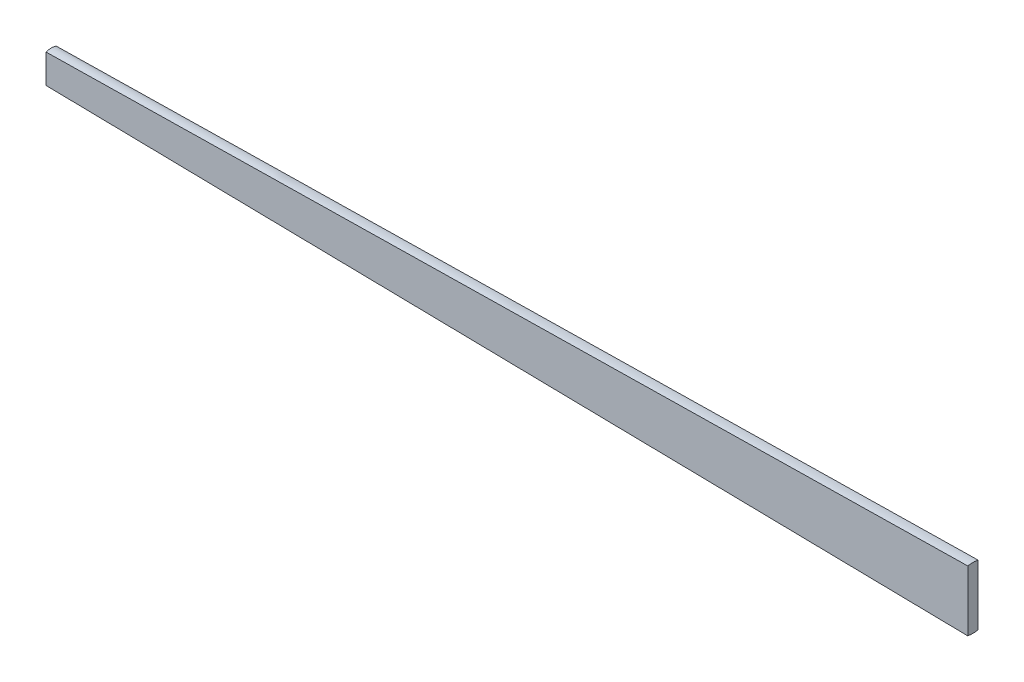
ISO-10303-21;
HEADER;
FILE_DESCRIPTION(('STEP AP214'),'2;1');
FILE_NAME('part.step','',(''),(''),'','','');
FILE_SCHEMA(('AUTOMOTIVE_DESIGN { 1 0 10303 214 1 1 1 1 }'));
ENDSEC;
DATA;
#1=APPLICATION_CONTEXT('core data for automotive mechanical design processes');
#2=APPLICATION_PROTOCOL_DEFINITION('international standard','automotive_design',2000,#1);
#3=PRODUCT_CONTEXT('',#1,'mechanical');
#4=PRODUCT('Part','Part','',(#3));
#5=PRODUCT_RELATED_PRODUCT_CATEGORY('part','',(#4));
#6=PRODUCT_DEFINITION_FORMATION('','',#4);
#7=PRODUCT_DEFINITION_CONTEXT('part definition',#1,'design');
#8=PRODUCT_DEFINITION('design','',#6,#7);
#9=PRODUCT_DEFINITION_SHAPE('','',#8);
#10=(LENGTH_UNIT() NAMED_UNIT(*) SI_UNIT(.MILLI.,.METRE.));
#11=(NAMED_UNIT(*) PLANE_ANGLE_UNIT() SI_UNIT($,.RADIAN.));
#12=(NAMED_UNIT(*) SI_UNIT($,.STERADIAN.) SOLID_ANGLE_UNIT());
#13=UNCERTAINTY_MEASURE_WITH_UNIT(LENGTH_MEASURE(1.E-05),#10,'distance_accuracy_value','');
#14=(GEOMETRIC_REPRESENTATION_CONTEXT(3) GLOBAL_UNCERTAINTY_ASSIGNED_CONTEXT((#13)) GLOBAL_UNIT_ASSIGNED_CONTEXT((#10,
#11,#12)) REPRESENTATION_CONTEXT('',''));
#15=CARTESIAN_POINT('',(0.,0.,0.));
#16=DIRECTION('',(0.,0.,1.));
#17=DIRECTION('',(1.,0.,0.));
#18=AXIS2_PLACEMENT_3D('',#15,#16,#17);
#19=CARTESIAN_POINT('',(-10.5482343550447,2.95803989154981,-0.500000000000001));
#20=DIRECTION('',(0.,0.,1.));
#21=DIRECTION('',(1.,0.,0.));
#22=AXIS2_PLACEMENT_3D('',#19,#20,#21);
#23=PLANE('',#22);
#24=CARTESIAN_POINT('',(169.656200493974,-4.47539671188116,-0.500000000000001));
#25=CARTESIAN_POINT('',(166.703664294802,-4.42588148318487,-0.500000000000001));
#26=CARTESIAN_POINT('',(163.7511282617,-4.37635634763244,-0.500000000000001));
#27=CARTESIAN_POINT('',(154.893500783821,-4.22774699927117,-0.500000000000001));
#28=CARTESIAN_POINT('',(148.988409902847,-4.12862917903997,-0.500000000000001));
#29=CARTESIAN_POINT('',(140.130794713221,-3.97987001919217,-0.500000000000001));
#30=CARTESIAN_POINT('',(137.178269709589,-3.93027006028798,-0.500000000000001));
#31=CARTESIAN_POINT('',(131.273220624869,-3.83103897027866,-0.500000000000001));
#32=CARTESIAN_POINT('',(128.320696543779,-3.78140783917772,-0.500000000000001));
#33=CARTESIAN_POINT('',(113.558381591971,-3.53317134744906,-0.500000000000001));
#34=CARTESIAN_POINT('',(101.748595056309,-3.33430815609334,-0.500000000000001));
#35=CARTESIAN_POINT('',(78.1290247302832,-2.93568248590202,-0.500000000000001));
#36=CARTESIAN_POINT('',(66.3192409399358,-2.73592000612206,-0.500000000000001));
#37=CARTESIAN_POINT('',(48.6042378005402,-2.4349762757184,-0.500000000000001));
#38=CARTESIAN_POINT('',(42.6990074646239,-2.33444203687679,-0.500000000000001));
#39=CARTESIAN_POINT('',(30.8885576156638,-2.13273241991245,-0.500000000000001));
#40=CARTESIAN_POINT('',(24.9833381026202,-2.0315570417773,-0.500000000000001));
#41=CARTESIAN_POINT('',(13.1729426179408,-1.82821800924407,-0.500000000000001));
#42=CARTESIAN_POINT('',(7.26776664622875,-1.72605435928811,-0.500000000000001));
#43=CARTESIAN_POINT('',(-4.54255679545612,-1.52010252339596,-0.500000000000001));
#44=CARTESIAN_POINT('',(-10.4477042654303,-1.41631433754119,-0.500000000000001));
#45=CARTESIAN_POINT('',(-19.8607121926004,-1.24840302755795,-0.500000000000001));
#46=CARTESIAN_POINT('',(-23.3685904619583,-1.18528205395844,-0.500000000000001));
#47=CARTESIAN_POINT('',(-28.6304048779247,-1.08925819863948,-0.500000000000001));
#48=CARTESIAN_POINT('',(-30.3843532560918,-1.05702631294972,-0.500000000000001));
#49=CARTESIAN_POINT('',(-33.8922387762595,-0.991971156105052,-0.500000000000001));
#50=CARTESIAN_POINT('',(-35.6461759182617,-0.95914788504594,-0.500000000000001));
#51=CARTESIAN_POINT('',(-39.1537391622848,-0.892710640547073,-0.500000000000001));
#52=CARTESIAN_POINT('',(-40.9073652668422,-0.85909680148814,-0.500000000000001));
#53=CARTESIAN_POINT('',(-44.4145966644938,-0.790743750861814,-0.500000000000001));
#54=CARTESIAN_POINT('',(-46.1682019575744,-0.756004538598459,-0.500000000000001));
#55=CARTESIAN_POINT('',(-49.6753155931781,-0.684864605735015,-0.500000000000001));
#56=CARTESIAN_POINT('',(-51.4288239369102,-0.648463945464205,-0.500000000000001));
#57=CARTESIAN_POINT('',(-54.0590409304299,-0.591800346433795,-0.500000000000001));
#58=CARTESIAN_POINT('',(-54.9357717583456,-0.57256872545883,-0.500000000000001));
#59=CARTESIAN_POINT('',(-56.6892123367694,-0.533169854457441,-0.500000000000001));
#60=CARTESIAN_POINT('',(-57.5659220872829,-0.513002604671453,-0.500000000000001));
#61=CARTESIAN_POINT('',(-58.8808841717626,-0.481759113686868,-0.500000000000001));
#62=CARTESIAN_POINT('',(-59.3191483164453,-0.47118017792183,-0.500000000000001));
#63=CARTESIAN_POINT('',(-60.1956673174125,-0.44961405346666,-0.500000000000001));
#64=CARTESIAN_POINT('',(-60.6339221736804,-0.438626864098665,-0.500000000000001));
#65=CARTESIAN_POINT('',(-61.510457145471,-0.416143205002311,-0.500000000000001));
#66=CARTESIAN_POINT('',(-61.9487372598603,-0.404646690913835,-0.500000000000001));
#67=CARTESIAN_POINT('',(-62.8252777193756,-0.38099961863476,-0.500000000000001));
#68=CARTESIAN_POINT('',(-63.263538064589,-0.368849063699181,-0.500000000000001));
#69=CARTESIAN_POINT('',(-64.1402692280099,-0.343670145233357,-0.500000000000001));
#70=CARTESIAN_POINT('',(-64.5787400329393,-0.330641314085127,-0.500000000000001));
#71=CARTESIAN_POINT('',(-65.4556510709307,-0.303344488101742,-0.500000000000001));
#72=CARTESIAN_POINT('',(-65.8940913032958,-0.289076470844608,-0.500000000000001));
#73=CARTESIAN_POINT('',(-66.7708240751146,-0.258681747216344,-0.500000000000001));
#74=CARTESIAN_POINT('',(-67.2091166266868,-0.24255540462692,-0.500000000000001));
#75=CARTESIAN_POINT('',(-67.8664455638075,-0.215815756695963,-0.500000000000001));
#76=CARTESIAN_POINT('',(-68.08553347561,-0.206477684036087,-0.500000000000001));
#77=CARTESIAN_POINT('',(-68.5236507261605,-0.186527394984247,-0.500000000000001));
#78=CARTESIAN_POINT('',(-68.7426800654896,-0.175915191738358,-0.500000000000001));
#79=CARTESIAN_POINT('',(-69.0711791295375,-0.158363865471682,-0.500000000000001));
#80=CARTESIAN_POINT('',(-69.180691716543,-0.152239960556255,-0.500000000000001));
#81=CARTESIAN_POINT('',(-69.3996971098207,-0.139193279631371,-0.500000000000001));
#82=CARTESIAN_POINT('',(-69.5091899037649,-0.132270298601008,-0.500000000000001));
#83=CARTESIAN_POINT('',(-69.7280470867871,-0.117223951085627,-0.500000000000001));
#84=CARTESIAN_POINT('',(-69.8374115121909,-0.109101158231657,-0.500000000000001));
#85=CARTESIAN_POINT('',(-70.0012830618837,-0.0951250513520667,-0.500000000000001));
#86=CARTESIAN_POINT('',(-70.0558678904127,-0.0901687526846374,-0.500000000000001));
#87=CARTESIAN_POINT('',(-70.1649434207622,-0.0793166070241496,-0.500000000000001));
#88=CARTESIAN_POINT('',(-70.2194341409384,-0.0734209708744558,-0.500000000000001));
#89=CARTESIAN_POINT('',(-70.3010086009303,-0.0630860165540142,-0.500000000000001));
#90=CARTESIAN_POINT('',(-70.3281917433004,-0.0593893994979068,-0.500000000000001));
#91=CARTESIAN_POINT('',(-70.3824393092316,-0.0512078894224137,-0.500000000000001));
#92=CARTESIAN_POINT('',(-70.4095038302419,-0.0467238646062233,-0.500000000000001));
#93=CARTESIAN_POINT('',(-70.449767033295,-0.038503253067891,-0.500000000000001));
#94=CARTESIAN_POINT('',(-70.4631372633285,-0.0355126058698513,-0.500000000000001));
#95=CARTESIAN_POINT('',(-70.4898346304535,-0.0286811286145645,-0.500000000000001));
#96=CARTESIAN_POINT('',(-70.5031611626841,-0.0248358726180172,-0.500000000000001));
#97=CARTESIAN_POINT('',(-70.5189920479394,-0.0179522509488759,-0.500000000000001));
#98=CARTESIAN_POINT('',(-70.5221493660641,-0.016454041373148,-0.500000000000001));
#99=CARTESIAN_POINT('',(-70.5282164673285,-0.0130463525437288,-0.500000000000001));
#100=CARTESIAN_POINT('',(-70.5311295814214,-0.0111444150867734,-0.500000000000001));
#101=CARTESIAN_POINT('',(-70.5341128071544,-0.00830005859882704,-0.500000000000001));
#102=CARTESIAN_POINT('',(-70.5345927065407,-0.00780751829092787,-0.500000000000001));
#103=CARTESIAN_POINT('',(-70.5354988825439,-0.00677267531348738,-0.500000000000001));
#104=CARTESIAN_POINT('',(-70.53592503823,-0.00623026500595271,-0.500000000000001));
#105=CARTESIAN_POINT('',(-70.5367044150295,-0.00508253231309133,-0.500000000000001));
#106=CARTESIAN_POINT('',(-70.5370565068781,-0.00447642167258438,-0.500000000000001));
#107=CARTESIAN_POINT('',(-70.5376402847741,-0.0032089449250485,-0.500000000000001));
#108=CARTESIAN_POINT('',(-70.537872470829,-0.00254782184694039,-0.500000000000001));
#109=CARTESIAN_POINT('',(-70.5381300509284,-0.00139971656199998,-0.500000000000001));
#110=CARTESIAN_POINT('',(-70.5381971940578,-0.000922122662812118,-0.500000000000001));
#111=CARTESIAN_POINT('',(-70.5382480406264,3.75242880553563E-05,-0.500000000000001));
#112=CARTESIAN_POINT('',(-70.5382317784681,0.000519575419359218,-0.500000000000001));
#113=CARTESIAN_POINT('',(-70.5381178965543,0.00147236793566272,-0.500000000000001));
#114=CARTESIAN_POINT('',(-70.5380204925058,0.00194313590577232,-0.500000000000001));
#115=CARTESIAN_POINT('',(-70.5377549229276,0.00286414571440422,-0.500000000000001));
#116=CARTESIAN_POINT('',(-70.5375866878066,0.00331436688228998,-0.500000000000001));
#117=CARTESIAN_POINT('',(-70.5370805250553,0.00443896649208909,-0.500000000000001));
#118=CARTESIAN_POINT('',(-70.5367005766963,0.00509426352120476,-0.500000000000001));
#119=CARTESIAN_POINT('',(-70.5358461312165,0.00633979415108712,-0.500000000000001));
#120=CARTESIAN_POINT('',(-70.5353713431505,0.00692981863622136,-0.500000000000001));
#121=CARTESIAN_POINT('',(-70.5336297211295,0.00887017026401274,-0.500000000000001));
#122=CARTESIAN_POINT('',(-70.5322125376018,0.0100826129074068,-0.500000000000001));
#123=CARTESIAN_POINT('',(-70.5292255565044,0.0123022808543086,-0.500000000000001));
#124=CARTESIAN_POINT('',(-70.5276547999338,0.0133080766023809,-0.500000000000001));
#125=CARTESIAN_POINT('',(-70.5200747480668,0.0177656168716723,-0.500000000000001));
#126=CARTESIAN_POINT('',(-70.5136187603176,0.0204253440446399,-0.500000000000001));
#127=CARTESIAN_POINT('',(-70.5005269121437,0.0251652815265326,-0.500000000000001));
#128=CARTESIAN_POINT('',(-70.4938904908599,0.0272433846113111,-0.500000000000001));
#129=CARTESIAN_POINT('',(-70.4607948974316,0.0368083830401033,-0.500000000000001));
#130=CARTESIAN_POINT('',(-70.4337124878969,0.0421309377949997,-0.500000000000001));
#131=CARTESIAN_POINT('',(-70.3794803350955,0.0516514435500193,-0.500000000000001));
#132=CARTESIAN_POINT('',(-70.3523307138395,0.0558507549265817,-0.500000000000001));
#133=CARTESIAN_POINT('',(-70.2709016464803,0.0673806055735255,-0.500000000000001));
#134=CARTESIAN_POINT('',(-70.2164567768172,0.0736790205104799,-0.500000000000001));
#135=CARTESIAN_POINT('',(-70.1074539347499,0.085200114193457,-0.500000000000001));
#136=CARTESIAN_POINT('',(-70.0528959175376,0.0904222179465714,-0.500000000000001));
#137=CARTESIAN_POINT('',(-69.9436910883569,0.100155814943255,-0.500000000000001));
#138=CARTESIAN_POINT('',(-69.8890442517458,0.104667055314825,-0.500000000000001));
#139=CARTESIAN_POINT('',(-69.7797284139586,0.113217429142979,-0.500000000000001));
#140=CARTESIAN_POINT('',(-69.7250594205641,0.117256668877464,-0.500000000000001));
#141=CARTESIAN_POINT('',(-69.4518803254721,0.13662801981204,-0.500000000000001));
#142=CARTESIAN_POINT('',(-69.2331998226155,0.149538255395906,-0.500000000000001));
#143=CARTESIAN_POINT('',(-68.7957026977916,0.173208459147517,-0.500000000000001));
#144=CARTESIAN_POINT('',(-68.576886060327,0.183968104492899,-0.500000000000001));
#145=CARTESIAN_POINT('',(-68.1392551796517,0.20413688850278,-0.500000000000001));
#146=CARTESIAN_POINT('',(-67.9204409555597,0.213546432845153,-0.500000000000001));
#147=CARTESIAN_POINT('',(-67.4827907431373,0.231479802406062,-0.500000000000001));
#148=CARTESIAN_POINT('',(-67.2639547569524,0.240003681685902,-0.500000000000001));
#149=CARTESIAN_POINT('',(-66.6074698905888,0.264620522552514,-0.500000000000001));
#150=CARTESIAN_POINT('',(-66.1697853159204,0.27976123325672,-0.500000000000001));
#151=CARTESIAN_POINT('',(-65.294365852186,0.30852128424575,-0.500000000000001));
#152=CARTESIAN_POINT('',(-64.8566309629206,0.322140618277633,-0.500000000000001));
#153=CARTESIAN_POINT('',(-63.5433512476529,0.361462773293233,-0.500000000000001));
#154=CARTESIAN_POINT('',(-62.6677605862346,0.385628735655631,-0.500000000000001));
#155=CARTESIAN_POINT('',(-60.9164483205709,0.431726471287231,-0.500000000000001));
#156=CARTESIAN_POINT('',(-60.0407267115126,0.453658055642433,-0.500000000000001));
#157=CARTESIAN_POINT('',(-58.2892606507878,0.496046602468688,-0.500000000000001));
#158=CARTESIAN_POINT('',(-57.4135161996418,0.516503586470648,-0.500000000000001));
#159=CARTESIAN_POINT('',(-54.7863755504253,0.576370027665599,-0.500000000000001));
#160=CARTESIAN_POINT('',(-53.0349453920002,0.614278150175707,-0.500000000000001));
#161=CARTESIAN_POINT('',(-49.5320379649825,0.687869510045739,-0.500000000000001));
#162=CARTESIAN_POINT('',(-47.7805606963598,0.723552745943004,-0.500000000000001));
#163=CARTESIAN_POINT('',(-44.2775647886321,0.793480099924085,-0.500000000000001));
#164=CARTESIAN_POINT('',(-42.5260461493194,0.827724207572767,-0.500000000000001));
#165=CARTESIAN_POINT('',(-39.0229904516562,0.895226026301716,-0.500000000000001));
#166=CARTESIAN_POINT('',(-37.2714533933112,0.928483737661758,-0.500000000000001));
#167=CARTESIAN_POINT('',(-32.0169856751853,1.02720288168705,-0.500000000000001));
#168=CARTESIAN_POINT('',(-28.514035303753,1.09161352043219,-0.500000000000001));
#169=CARTESIAN_POINT('',(-21.5081155805338,1.2188341835437,-0.500000000000001));
#170=CARTESIAN_POINT('',(-18.0051462288282,1.28164421241948,-0.500000000000001));
#171=CARTESIAN_POINT('',(-10.6689277173787,1.41210379956409,-0.500000000000001));
#172=CARTESIAN_POINT('',(-6.83567674451766,1.47965132675229,-0.500000000000001));
#173=CARTESIAN_POINT('',(0.830839467039884,1.61393259771388,-0.500000000000001));
#174=CARTESIAN_POINT('',(4.66410470573657,1.68066634147755,-0.500000000000001));
#175=CARTESIAN_POINT('',(16.1639152012695,1.88003261610512,-0.500000000000001));
#176=CARTESIAN_POINT('',(23.8304749233311,2.01183018476687,-0.500000000000001));
#177=CARTESIAN_POINT('',(39.1636235680792,2.27423458835793,-0.500000000000001));
#178=CARTESIAN_POINT('',(46.8302124907893,2.40484142190741,-0.500000000000001));
#179=CARTESIAN_POINT('',(62.163402684773,2.66531792589475,-0.500000000000001));
#180=CARTESIAN_POINT('',(69.8300039560463,2.79518759634917,-0.500000000000001));
#181=CARTESIAN_POINT('',(85.1633052113104,3.05444882913877,-0.500000000000001));
#182=CARTESIAN_POINT('',(92.8300051953969,3.18384038580521,-0.500000000000001));
#183=CARTESIAN_POINT('',(108.163410821704,3.44229038152573,-0.500000000000001));
#184=CARTESIAN_POINT('',(115.830116463924,3.57134882057788,-0.500000000000001));
#185=CARTESIAN_POINT('',(138.830235386331,3.958170210238,-0.500000000000001));
#186=CARTESIAN_POINT('',(154.163654617357,4.2155793001108,-0.500000000000001));
#187=CARTESIAN_POINT('',(169.550118969223,4.47361768319346,-0.500000000000001));
#188=CARTESIAN_POINT('',(169.603159731573,4.47450719908985,-0.500000000000001));
#189=CARTESIAN_POINT('',(169.656200493974,4.4753967118812,-0.500000000000001));
#190=B_SPLINE_CURVE_WITH_KNOTS('',3,(#24,#25,#26,#27,#28,#29,#30,#31,#32,#33,#34,#35,#36,#37,
#38,#39,#40,#41,#42,#43,#44,#45,#46,#47,#48,#49,#50,#51,#52,#53,#54,#55,#56,#57,#58,#59,#60,#61,
#62,#63,#64,#65,#66,#67,#68,#69,#70,#71,#72,#73,#74,#75,#76,#77,#78,#79,#80,#81,#82,#83,#84,#85,
#86,#87,#88,#89,#90,#91,#92,#93,#94,#95,#96,#97,#98,#99,#100,#101,#102,#103,#104,#105,#106,#107,
#108,#109,#110,#111,#112,#113,#114,#115,#116,#117,#118,#119,#120,#121,#122,#123,#124,#125,#126,
#127,#128,#129,#130,#131,#132,#133,#134,#135,#136,#137,#138,#139,#140,#141,#142,#143,#144,#145,
#146,#147,#148,#149,#150,#151,#152,#153,#154,#155,#156,#157,#158,#159,#160,#161,#162,#163,#164,
#165,#166,#167,#168,#169,#170,#171,#172,#173,#174,#175,#176,#177,#178,#179,#180,#181,#182,#183,
#184,#185,#186,#187,#188,#189),.UNSPECIFIED.,.F.,.F.,(4,2,2,2,2,2,2,2,2,2,2,2,2,2,2,2,2,2,2,2,2,
2,2,2,2,2,2,2,2,2,2,2,2,2,2,2,2,2,2,2,2,2,2,2,2,2,2,2,2,2,2,2,2,2,2,2,2,2,2,2,2,2,2,2,2,2,2,2,2,
2,2,2,2,2,2,2,2,2,2,2,2,2,4),(0.,8.85885409576343,26.5766221228227,35.4354469023524,
44.2942704859123,79.7286526655943,115.163072063759,132.881330199528,150.599588678476,
168.317767553834,186.035945541324,196.561283590795,201.824017051998,207.086749660777,
212.348594084307,217.610441761974,222.872098527062,225.502923411211,228.1337476193,
229.448922888453,230.76410034142,232.07939256707,233.394678247403,234.710669838581,
236.026685246431,237.342443470223,238.000302045535,238.658153833855,238.987202305085,
239.316335389539,239.645311621489,239.809740370115,239.974132262983,240.056441217294,
240.138659980389,240.179799027703,240.221156311888,240.23164303465,240.24194882557,
240.244008730076,240.246073189949,240.248167151128,240.250252308504,240.251692502244,
240.253132101989,240.25456788688,240.256005085727,240.258264333713,240.260530622019,
240.266082544123,240.271671668435,240.292470077677,240.313342891909,240.395898740007,
240.478354146092,240.642698959041,240.807131342907,240.971622088104,241.136075724125,
241.793220199753,242.450463244542,243.107508385727,243.764513397056,245.078346897348,
246.392185797369,249.019951285083,251.647938763179,254.275887861778,259.531405946981,
264.78692748717,270.042487128628,275.298045279419,285.808671981592,296.319269068953,
307.820807129216,319.322345326871,342.32542266498,365.328526655429,388.331630128926,
411.335005468137,434.338380940854,480.345120019314,480.504264681124),.UNSPECIFIED.);
#191=CARTESIAN_POINT('',(79.4617656449553,-2.9580398915498,-0.500000000000001));
#192=VERTEX_POINT('',#191);
#193=CARTESIAN_POINT('',(-10.5382343550447,-1.41421356237309,-0.500000000000001));
#194=VERTEX_POINT('',#193);
#195=EDGE_CURVE('E77',#192,#194,#190,.T.);
#196=ORIENTED_EDGE('',*,*,#195,.T.);
#197=DIRECTION('',(0.,1.,0.));
#198=VECTOR('',#197,1.);
#199=CARTESIAN_POINT('',(-10.5382343550447,0.,-0.500000000000001));
#200=LINE('',#199,#198);
#201=CARTESIAN_POINT('',(-10.5382343550447,1.41421356237309,-0.500000000000001));
#202=VERTEX_POINT('',#201);
#203=EDGE_CURVE('E86',#194,#202,#200,.T.);
#204=ORIENTED_EDGE('',*,*,#203,.T.);
#205=CARTESIAN_POINT('',(79.4617656449553,2.95803989154982,-0.500000000000001));
#206=VERTEX_POINT('',#205);
#207=EDGE_CURVE('E79',#202,#206,#190,.T.);
#208=ORIENTED_EDGE('',*,*,#207,.T.);
#209=DIRECTION('',(0.,-1.,0.));
#210=VECTOR('',#209,1.);
#211=CARTESIAN_POINT('',(79.4617656449553,3.00000000000001,-0.500000000000001));
#212=LINE('',#211,#210);
#213=EDGE_CURVE('E38',#206,#192,#212,.T.);
#214=ORIENTED_EDGE('',*,*,#213,.T.);
#215=EDGE_LOOP('',(#196,#204,#208,#214));
#216=FACE_BOUND('',#215,.T.);
#217=ADVANCED_FACE('F33',(#216),#23,.F.);
#218=CARTESIAN_POINT('',(-10.5482343550447,2.95803989154981,0.499999999999999));
#219=DIRECTION('',(0.,0.,1.));
#220=DIRECTION('',(1.,0.,0.));
#221=AXIS2_PLACEMENT_3D('',#218,#219,#220);
#222=PLANE('',#221);
#223=CARTESIAN_POINT('',(169.656200493974,-4.47539671188116,0.499999999999999));
#224=CARTESIAN_POINT('',(166.703664294802,-4.42588148318487,0.499999999999999));
#225=CARTESIAN_POINT('',(163.7511282617,-4.37635634763244,0.499999999999999));
#226=CARTESIAN_POINT('',(154.893500783821,-4.22774699927117,0.499999999999999));
#227=CARTESIAN_POINT('',(148.988409902847,-4.12862917903997,0.499999999999999));
#228=CARTESIAN_POINT('',(140.130794713221,-3.97987001919217,0.499999999999999));
#229=CARTESIAN_POINT('',(137.178269709589,-3.93027006028798,0.499999999999999));
#230=CARTESIAN_POINT('',(131.273220624869,-3.83103897027866,0.499999999999999));
#231=CARTESIAN_POINT('',(128.320696543779,-3.78140783917772,0.499999999999999));
#232=CARTESIAN_POINT('',(113.558381591971,-3.53317134744906,0.499999999999999));
#233=CARTESIAN_POINT('',(101.748595056309,-3.33430815609334,0.499999999999999));
#234=CARTESIAN_POINT('',(78.1290247302833,-2.93568248590202,0.499999999999999));
#235=CARTESIAN_POINT('',(66.3192409399359,-2.73592000612207,0.499999999999999));
#236=CARTESIAN_POINT('',(48.6042378005403,-2.4349762757184,0.499999999999999));
#237=CARTESIAN_POINT('',(42.6990074646241,-2.33444203687679,0.499999999999999));
#238=CARTESIAN_POINT('',(30.8885576156639,-2.13273241991245,0.499999999999999));
#239=CARTESIAN_POINT('',(24.9833381026203,-2.0315570417773,0.499999999999999));
#240=CARTESIAN_POINT('',(13.1729426179409,-1.82821800924407,0.499999999999999));
#241=CARTESIAN_POINT('',(7.2677666462288,-1.72605435928811,0.499999999999999));
#242=CARTESIAN_POINT('',(-4.5425567954561,-1.52010252339596,0.499999999999999));
#243=CARTESIAN_POINT('',(-10.4477042654303,-1.41631433754119,0.499999999999999));
#244=CARTESIAN_POINT('',(-19.8607121926005,-1.24840302755795,0.499999999999999));
#245=CARTESIAN_POINT('',(-23.3685904619584,-1.18528205395844,0.499999999999999));
#246=CARTESIAN_POINT('',(-28.6304048779247,-1.08925819863948,0.499999999999999));
#247=CARTESIAN_POINT('',(-30.3843532560919,-1.05702631294972,0.499999999999999));
#248=CARTESIAN_POINT('',(-33.8922387762596,-0.99197115610505,0.499999999999999));
#249=CARTESIAN_POINT('',(-35.6461759182619,-0.959147885045938,0.499999999999999));
#250=CARTESIAN_POINT('',(-39.1537391622849,-0.892710640547071,0.499999999999999));
#251=CARTESIAN_POINT('',(-40.9073652668423,-0.859096801488139,0.499999999999999));
#252=CARTESIAN_POINT('',(-44.4145966644939,-0.790743750861813,0.499999999999999));
#253=CARTESIAN_POINT('',(-46.1682019575745,-0.756004538598457,0.499999999999999));
#254=CARTESIAN_POINT('',(-49.6753155931781,-0.684864605735014,0.499999999999999));
#255=CARTESIAN_POINT('',(-51.4288239369103,-0.648463945464205,0.499999999999999));
#256=CARTESIAN_POINT('',(-54.0590409304299,-0.591800346433796,0.499999999999999));
#257=CARTESIAN_POINT('',(-54.9357717583456,-0.57256872545883,0.499999999999999));
#258=CARTESIAN_POINT('',(-56.6892123367694,-0.533169854457441,0.499999999999999));
#259=CARTESIAN_POINT('',(-57.5659220872829,-0.513002604671454,0.499999999999999));
#260=CARTESIAN_POINT('',(-58.8808841717626,-0.48175911368687,0.499999999999999));
#261=CARTESIAN_POINT('',(-59.3191483164453,-0.471180177921832,0.499999999999999));
#262=CARTESIAN_POINT('',(-60.1956673174125,-0.449614053466663,0.499999999999999));
#263=CARTESIAN_POINT('',(-60.6339221736804,-0.438626864098667,0.499999999999999));
#264=CARTESIAN_POINT('',(-61.5104571454709,-0.416143205002313,0.499999999999999));
#265=CARTESIAN_POINT('',(-61.9487372598603,-0.404646690913838,0.499999999999999));
#266=CARTESIAN_POINT('',(-62.8252777193755,-0.380999618634764,0.499999999999999));
#267=CARTESIAN_POINT('',(-63.2635380645889,-0.368849063699184,0.499999999999999));
#268=CARTESIAN_POINT('',(-64.1402692280098,-0.34367014523336,0.499999999999999));
#269=CARTESIAN_POINT('',(-64.5787400329393,-0.330641314085131,0.499999999999999));
#270=CARTESIAN_POINT('',(-65.4556510709307,-0.303344488101746,0.499999999999999));
#271=CARTESIAN_POINT('',(-65.8940913032957,-0.28907647084461,0.499999999999999));
#272=CARTESIAN_POINT('',(-66.7708240751146,-0.258681747216347,0.499999999999999));
#273=CARTESIAN_POINT('',(-67.2091166266868,-0.242555404626924,0.499999999999999));
#274=CARTESIAN_POINT('',(-67.8664455638075,-0.215815756695967,0.499999999999999));
#275=CARTESIAN_POINT('',(-68.08553347561,-0.20647768403609,0.499999999999999));
#276=CARTESIAN_POINT('',(-68.5236507261605,-0.186527394984251,0.499999999999999));
#277=CARTESIAN_POINT('',(-68.7426800654896,-0.175915191738364,0.499999999999999));
#278=CARTESIAN_POINT('',(-69.0711791295375,-0.158363865471686,0.499999999999999));
#279=CARTESIAN_POINT('',(-69.180691716543,-0.152239960556257,0.499999999999999));
#280=CARTESIAN_POINT('',(-69.3996971098207,-0.139193279631373,0.499999999999999));
#281=CARTESIAN_POINT('',(-69.5091899037649,-0.132270298601012,0.499999999999999));
#282=CARTESIAN_POINT('',(-69.7280470867871,-0.117223951085633,0.499999999999999));
#283=CARTESIAN_POINT('',(-69.8374115121909,-0.109101158231665,0.499999999999999));
#284=CARTESIAN_POINT('',(-70.0012830618838,-0.0951250513520696,0.499999999999999));
#285=CARTESIAN_POINT('',(-70.0558678904127,-0.0901687526846381,0.499999999999999));
#286=CARTESIAN_POINT('',(-70.1649434207622,-0.079316607024152,0.499999999999999));
#287=CARTESIAN_POINT('',(-70.2194341409384,-0.073420970874462,0.499999999999999));
#288=CARTESIAN_POINT('',(-70.3010086009303,-0.0630860165540259,0.499999999999999));
#289=CARTESIAN_POINT('',(-70.3281917433004,-0.0593893994979205,0.499999999999999));
#290=CARTESIAN_POINT('',(-70.3824393092316,-0.0512078894224281,0.499999999999999));
#291=CARTESIAN_POINT('',(-70.4095038302419,-0.0467238646062361,0.499999999999999));
#292=CARTESIAN_POINT('',(-70.449767033295,-0.038503253067905,0.499999999999999));
#293=CARTESIAN_POINT('',(-70.4631372633285,-0.035512605869866,0.499999999999999));
#294=CARTESIAN_POINT('',(-70.4898346304535,-0.0286811286145876,0.499999999999999));
#295=CARTESIAN_POINT('',(-70.5031611626842,-0.0248358726180482,0.499999999999999));
#296=CARTESIAN_POINT('',(-70.5189920479394,-0.0179522509488973,0.499999999999999));
#297=CARTESIAN_POINT('',(-70.5221493660641,-0.0164540413731687,0.499999999999999));
#298=CARTESIAN_POINT('',(-70.5282164673285,-0.0130463525437786,0.499999999999999));
#299=CARTESIAN_POINT('',(-70.5311295814214,-0.0111444150868513,0.499999999999999));
#300=CARTESIAN_POINT('',(-70.5341128071544,-0.00830005859888428,0.499999999999999));
#301=CARTESIAN_POINT('',(-70.5345927065408,-0.00780751829097454,0.499999999999999));
#302=CARTESIAN_POINT('',(-70.535498882544,-0.00677267531353107,0.499999999999999));
#303=CARTESIAN_POINT('',(-70.53592503823,-0.00623026500600483,0.499999999999999));
#304=CARTESIAN_POINT('',(-70.5367044150296,-0.00508253231314861,0.499999999999999));
#305=CARTESIAN_POINT('',(-70.5370565068782,-0.00447642167263718,0.499999999999999));
#306=CARTESIAN_POINT('',(-70.5376402847741,-0.00320894492509517,0.499999999999999));
#307=CARTESIAN_POINT('',(-70.5378724708291,-0.00254782184698699,0.499999999999999));
#308=CARTESIAN_POINT('',(-70.5381300509285,-0.00139971656205069,0.499999999999999));
#309=CARTESIAN_POINT('',(-70.5381971940578,-0.000922122662864802,0.499999999999999));
#310=CARTESIAN_POINT('',(-70.5382480406264,3.75242880010458E-05,0.499999999999999));
#311=CARTESIAN_POINT('',(-70.5382317784682,0.000519575419305245,0.499999999999999));
#312=CARTESIAN_POINT('',(-70.5381178965544,0.00147236793561197,0.499999999999999));
#313=CARTESIAN_POINT('',(-70.5380204925059,0.00194313590572422,0.499999999999999));
#314=CARTESIAN_POINT('',(-70.5377549229276,0.00286414571435465,0.499999999999999));
#315=CARTESIAN_POINT('',(-70.5375866878067,0.00331436688223722,0.499999999999999));
#316=CARTESIAN_POINT('',(-70.5370805250554,0.00443896649202779,0.499999999999999));
#317=CARTESIAN_POINT('',(-70.5367005766964,0.0050942635211352,0.499999999999999));
#318=CARTESIAN_POINT('',(-70.5358461312167,0.00633979415100653,0.499999999999999));
#319=CARTESIAN_POINT('',(-70.5353713431506,0.00692981863613768,0.499999999999999));
#320=CARTESIAN_POINT('',(-70.5336297211297,0.00887017026390579,0.499999999999999));
#321=CARTESIAN_POINT('',(-70.532212537602,0.0100826129072764,0.499999999999999));
#322=CARTESIAN_POINT('',(-70.5292255565047,0.0123022808541486,0.499999999999999));
#323=CARTESIAN_POINT('',(-70.5276547999341,0.013308076602215,0.499999999999999));
#324=CARTESIAN_POINT('',(-70.5200747480674,0.0177656168714404,0.499999999999999));
#325=CARTESIAN_POINT('',(-70.5136187603184,0.020425344044354,0.499999999999999));
#326=CARTESIAN_POINT('',(-70.5005269121448,0.0251652815261664,0.499999999999999));
#327=CARTESIAN_POINT('',(-70.4938904908612,0.0272433846109182,0.499999999999999));
#328=CARTESIAN_POINT('',(-70.460794897434,0.0368083830395781,0.499999999999999));
#329=CARTESIAN_POINT('',(-70.4337124879001,0.0421309377943827,0.499999999999999));
#330=CARTESIAN_POINT('',(-70.3794803351002,0.0516514435492557,0.499999999999999));
#331=CARTESIAN_POINT('',(-70.3523307138449,0.0558507549257622,0.499999999999999));
#332=CARTESIAN_POINT('',(-70.2709016464881,0.067380605572544,0.499999999999999));
#333=CARTESIAN_POINT('',(-70.2164567768266,0.0736790205094041,0.499999999999999));
#334=CARTESIAN_POINT('',(-70.1074539347625,0.0852001141922138,0.499999999999999));
#335=CARTESIAN_POINT('',(-70.0528959175517,0.090422217945255,0.499999999999999));
#336=CARTESIAN_POINT('',(-69.9436910883742,0.100155814941795,0.499999999999999));
#337=CARTESIAN_POINT('',(-69.8890442517646,0.104667055313296,0.499999999999999));
#338=CARTESIAN_POINT('',(-69.7797284139806,0.11321742914132,0.499999999999999));
#339=CARTESIAN_POINT('',(-69.7250594205877,0.117256668875745,0.499999999999999));
#340=CARTESIAN_POINT('',(-69.4518803255036,0.136628019810029,0.499999999999999));
#341=CARTESIAN_POINT('',(-69.2331998226532,0.1495382553937,0.499999999999999));
#342=CARTESIAN_POINT('',(-68.7957026978419,0.173208459144945,0.499999999999999));
#343=CARTESIAN_POINT('',(-68.5768860603837,0.183968104490159,0.499999999999999));
#344=CARTESIAN_POINT('',(-68.139255179721,0.204136888499722,0.499999999999999));
#345=CARTESIAN_POINT('',(-67.9204409556353,0.213546432841945,0.499999999999999));
#346=CARTESIAN_POINT('',(-67.4827907432254,0.231479802402566,0.499999999999999));
#347=CARTESIAN_POINT('',(-67.2639547570468,0.240003681682267,0.499999999999999));
#348=CARTESIAN_POINT('',(-66.6074698907021,0.264620522548474,0.499999999999999));
#349=CARTESIAN_POINT('',(-66.1697853160462,0.279761233252423,0.499999999999999));
#350=CARTESIAN_POINT('',(-65.2943658523369,0.308521284240956,0.499999999999999));
#351=CARTESIAN_POINT('',(-64.8566309630841,0.322140618272599,0.499999999999999));
#352=CARTESIAN_POINT('',(-63.5433512478542,0.361462773287495,0.499999999999999));
#353=CARTESIAN_POINT('',(-62.667760586461,0.385628735649447,0.499999999999999));
#354=CARTESIAN_POINT('',(-60.9164483208477,0.431726471280169,0.499999999999999));
#355=CARTESIAN_POINT('',(-60.0407267118145,0.45365805563494,0.499999999999999));
#356=CARTESIAN_POINT('',(-58.2892606511402,0.496046602460346,0.499999999999999));
#357=CARTESIAN_POINT('',(-57.4135162000194,0.516503586461887,0.499999999999999));
#358=CARTESIAN_POINT('',(-54.7863755508785,0.576370027655592,0.499999999999999));
#359=CARTESIAN_POINT('',(-53.0349453925038,0.614278150164882,0.499999999999999));
#360=CARTESIAN_POINT('',(-49.5320379655869,0.687869510033285,0.499999999999999));
#361=CARTESIAN_POINT('',(-47.7805606970145,0.723552745929739,0.499999999999999));
#362=CARTESIAN_POINT('',(-44.2775647893877,0.793480099909201,0.499999999999999));
#363=CARTESIAN_POINT('',(-42.5260461501253,0.827724207557074,0.499999999999999));
#364=CARTESIAN_POINT('',(-39.0229904525629,0.895226026284407,0.499999999999999));
#365=CARTESIAN_POINT('',(-37.2714533942683,0.928483737643642,0.499999999999999));
#366=CARTESIAN_POINT('',(-32.0169856762934,1.02720288166651,0.499999999999999));
#367=CARTESIAN_POINT('',(-28.5140353049617,1.09161352041003,0.499999999999999));
#368=CARTESIAN_POINT('',(-21.5081155819438,1.2188341835183,0.499999999999999));
#369=CARTESIAN_POINT('',(-18.0051462303389,1.28164421239245,0.499999999999999));
#370=CARTESIAN_POINT('',(-10.6689277189564,1.41210379953621,0.499999999999999));
#371=CARTESIAN_POINT('',(-6.83567674606185,1.47965132672513,0.499999999999999));
#372=CARTESIAN_POINT('',(0.830839465562835,1.61393259768812,0.499999999999999));
#373=CARTESIAN_POINT('',(4.6641047042931,1.68066634145245,0.499999999999999));
#374=CARTESIAN_POINT('',(16.1639151999268,1.88003261608198,0.499999999999999));
#375=CARTESIAN_POINT('',(23.8304749220555,2.01183018474498,0.499999999999999));
#376=CARTESIAN_POINT('',(39.163623566938,2.27423458833846,0.499999999999999));
#377=CARTESIAN_POINT('',(46.8302124897152,2.40484142188913,0.499999999999999));
#378=CARTESIAN_POINT('',(62.1634026838333,2.66531792587882,0.499999999999999));
#379=CARTESIAN_POINT('',(69.8300039551738,2.7951875963344,0.499999999999999));
#380=CARTESIAN_POINT('',(85.1633052105721,3.0544488291263,0.499999999999999));
#381=CARTESIAN_POINT('',(92.8300051947257,3.18384038579388,0.499999999999999));
#382=CARTESIAN_POINT('',(108.163410821167,3.44229038151669,0.499999999999999));
#383=CARTESIAN_POINT('',(115.830116463454,3.57134882056997,0.499999999999999));
#384=CARTESIAN_POINT('',(138.830235386062,3.95817021023349,0.499999999999999));
#385=CARTESIAN_POINT('',(154.163654617222,4.21557930010855,0.499999999999999));
#386=CARTESIAN_POINT('',(169.550118969222,4.47361768319345,0.499999999999999));
#387=CARTESIAN_POINT('',(169.603159731572,4.47450719908985,0.499999999999999));
#388=CARTESIAN_POINT('',(169.656200493974,4.4753967118812,0.499999999999999));
#389=B_SPLINE_CURVE_WITH_KNOTS('',3,(#223,#224,#225,#226,#227,#228,#229,#230,#231,#232,#233,
#234,#235,#236,#237,#238,#239,#240,#241,#242,#243,#244,#245,#246,#247,#248,#249,#250,#251,#252,
#253,#254,#255,#256,#257,#258,#259,#260,#261,#262,#263,#264,#265,#266,#267,#268,#269,#270,#271,
#272,#273,#274,#275,#276,#277,#278,#279,#280,#281,#282,#283,#284,#285,#286,#287,#288,#289,#290,
#291,#292,#293,#294,#295,#296,#297,#298,#299,#300,#301,#302,#303,#304,#305,#306,#307,#308,#309,
#310,#311,#312,#313,#314,#315,#316,#317,#318,#319,#320,#321,#322,#323,#324,#325,#326,#327,#328,
#329,#330,#331,#332,#333,#334,#335,#336,#337,#338,#339,#340,#341,#342,#343,#344,#345,#346,#347,
#348,#349,#350,#351,#352,#353,#354,#355,#356,#357,#358,#359,#360,#361,#362,#363,#364,#365,#366,
#367,#368,#369,#370,#371,#372,#373,#374,#375,#376,#377,#378,#379,#380,#381,#382,#383,#384,#385,
#386,#387,#388),.UNSPECIFIED.,.F.,.F.,(4,2,2,2,2,2,2,2,2,2,2,2,2,2,2,2,2,2,2,2,2,2,2,2,2,2,2,2,
2,2,2,2,2,2,2,2,2,2,2,2,2,2,2,2,2,2,2,2,2,2,2,2,2,2,2,2,2,2,2,2,2,2,2,2,2,2,2,2,2,2,2,2,2,2,2,2,
2,2,2,2,2,2,4),(0.,8.85885409576343,26.5766221228227,35.4354469023524,44.2942704859123,
79.7286526655942,115.163072063759,132.881330199528,150.599588678475,168.317767553834,
186.035945541324,196.561283590795,201.824017051998,207.086749660777,212.348594084307,
217.610441761974,222.872098527062,225.502923411211,228.1337476193,229.448922888453,
230.76410034142,232.07939256707,233.394678247402,234.710669838581,236.026685246431,
237.342443470223,238.000302045535,238.658153833855,238.987202305085,239.316335389539,
239.645311621489,239.809740370115,239.974132262983,240.056441217293,240.138659980389,
240.179799027703,240.221156311888,240.23164303465,240.24194882557,240.244008730076,
240.246073189949,240.248167151128,240.250252308504,240.251692502244,240.253132101989,
240.25456788688,240.256005085727,240.258264333713,240.260530622019,240.266082544123,
240.271671668435,240.292470077676,240.313342891908,240.395898740003,240.478354146086,
240.64269895903,240.807131342892,240.971622088084,241.1360757241,241.793220199709,
242.450463244479,243.107508385645,243.764513396956,245.07834689721,246.392185797193,
249.019951284832,251.647938762852,254.275887861375,259.531405946427,264.786927486465,
270.042487127772,275.298045278412,285.808671980283,296.319269067341,307.820807127705,
319.322345325461,342.325422663772,365.328526654422,388.33163012812,411.335005467533,
434.338380940451,480.345120019314,480.504264681124),.UNSPECIFIED.);
#390=CARTESIAN_POINT('',(79.4617656449553,-2.9580398915498,0.499999999999999));
#391=VERTEX_POINT('',#390);
#392=CARTESIAN_POINT('',(-10.5382343550447,-1.4142135623731,0.499999999999999));
#393=VERTEX_POINT('',#392);
#394=EDGE_CURVE('E107',#391,#393,#389,.T.);
#395=ORIENTED_EDGE('',*,*,#394,.F.);
#396=DIRECTION('',(0.,-1.,0.));
#397=VECTOR('',#396,1.);
#398=CARTESIAN_POINT('',(79.4617656449553,3.00000000000001,0.499999999999999));
#399=LINE('',#398,#397);
#400=CARTESIAN_POINT('',(79.4617656449553,2.95803989154982,0.499999999999999));
#401=VERTEX_POINT('',#400);
#402=EDGE_CURVE('E51',#401,#391,#399,.T.);
#403=ORIENTED_EDGE('',*,*,#402,.F.);
#404=CARTESIAN_POINT('',(-10.5382343550447,1.4142135623731,0.499999999999999));
#405=VERTEX_POINT('',#404);
#406=EDGE_CURVE('E113',#405,#401,#389,.T.);
#407=ORIENTED_EDGE('',*,*,#406,.F.);
#408=DIRECTION('',(0.,1.,0.));
#409=VECTOR('',#408,1.);
#410=CARTESIAN_POINT('',(-10.5382343550447,0.,0.499999999999999));
#411=LINE('',#410,#409);
#412=EDGE_CURVE('E93',#393,#405,#411,.T.);
#413=ORIENTED_EDGE('',*,*,#412,.F.);
#414=EDGE_LOOP('',(#395,#403,#407,#413));
#415=FACE_BOUND('',#414,.T.);
#416=ADVANCED_FACE('F102',(#415),#222,.T.);
#417=CARTESIAN_POINT('',(79.4617656449553,3.00000000000001,0.));
#418=DIRECTION('',(1.,0.,0.));
#419=DIRECTION('',(0.,1.,0.));
#420=AXIS2_PLACEMENT_3D('',#417,#418,#419);
#421=PLANE('',#420);
#422=ORIENTED_EDGE('',*,*,#213,.F.);
#423=CARTESIAN_POINT('',(79.4617656449553,0.,0.));
#424=DIRECTION('',(1.,0.,0.));
#425=DIRECTION('',(0.,1.,0.));
#426=AXIS2_PLACEMENT_3D('',#423,#424,#425);
#427=CIRCLE('',#426,3.);
#428=EDGE_CURVE('E11',#206,#401,#427,.T.);
#429=ORIENTED_EDGE('',*,*,#428,.T.);
#430=ORIENTED_EDGE('',*,*,#402,.T.);
#431=EDGE_CURVE('E43',#391,#192,#427,.T.);
#432=ORIENTED_EDGE('',*,*,#431,.T.);
#433=EDGE_LOOP('',(#422,#429,#430,#432));
#434=FACE_BOUND('',#433,.T.);
#435=ADVANCED_FACE('F87',(#434),#421,.T.);
#436=CARTESIAN_POINT('',(-10.5382343550447,0.,0.));
#437=DIRECTION('',(-1.,0.,0.));
#438=DIRECTION('',(0.,-1.,0.));
#439=AXIS2_PLACEMENT_3D('',#436,#437,#438);
#440=PLANE('',#439);
#441=ORIENTED_EDGE('',*,*,#203,.F.);
#442=CARTESIAN_POINT('',(-10.5382343550447,0.,0.));
#443=DIRECTION('',(1.,0.,0.));
#444=DIRECTION('',(0.,1.,0.));
#445=AXIS2_PLACEMENT_3D('',#442,#443,#444);
#446=CIRCLE('',#445,1.5);
#447=EDGE_CURVE('E85',#393,#194,#446,.T.);
#448=ORIENTED_EDGE('',*,*,#447,.F.);
#449=ORIENTED_EDGE('',*,*,#412,.T.);
#450=EDGE_CURVE('E88',#202,#405,#446,.T.);
#451=ORIENTED_EDGE('',*,*,#450,.F.);
#452=EDGE_LOOP('',(#441,#448,#449,#451));
#453=FACE_BOUND('',#452,.T.);
#454=ADVANCED_FACE('F118',(#453),#440,.T.);
#455=CARTESIAN_POINT('',(79.4617656449553,0.,0.));
#456=DIRECTION('',(1.,0.,0.));
#457=DIRECTION('',(0.,1.,0.));
#458=AXIS2_PLACEMENT_3D('',#455,#456,#457);
#459=CONICAL_SURFACE('',#458,3.,0.0166651237139408);
#460=ORIENTED_EDGE('',*,*,#207,.F.);
#461=ORIENTED_EDGE('',*,*,#450,.T.);
#462=ORIENTED_EDGE('',*,*,#406,.T.);
#463=ORIENTED_EDGE('',*,*,#428,.F.);
#464=EDGE_LOOP('',(#460,#461,#462,#463));
#465=FACE_BOUND('',#464,.T.);
#466=ADVANCED_FACE('F35',(#465),#459,.T.);
#467=ORIENTED_EDGE('',*,*,#195,.F.);
#468=ORIENTED_EDGE('',*,*,#431,.F.);
#469=ORIENTED_EDGE('',*,*,#394,.T.);
#470=ORIENTED_EDGE('',*,*,#447,.T.);
#471=EDGE_LOOP('',(#467,#468,#469,#470));
#472=FACE_BOUND('',#471,.T.);
#473=ADVANCED_FACE('F83',(#472),#459,.T.);
#474=CLOSED_SHELL('',(#217,#416,#435,#454,#466,#473));
#475=MANIFOLD_SOLID_BREP('B2',#474);
#476=ADVANCED_BREP_SHAPE_REPRESENTATION('',(#18,#475),#14);
#477=SHAPE_DEFINITION_REPRESENTATION(#9,#476);
ENDSEC;
END-ISO-10303-21;
